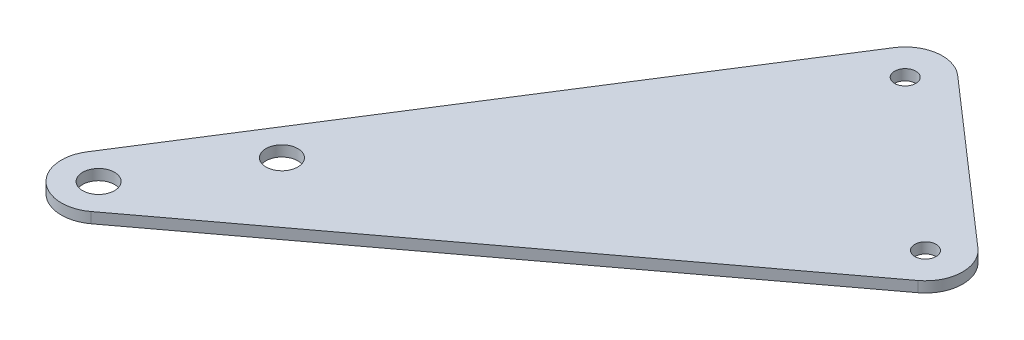
ISO-10303-21;
HEADER;
FILE_DESCRIPTION(('STEP AP214'),'2;1');
FILE_NAME('part.step','',(''),(''),'','','');
FILE_SCHEMA(('AUTOMOTIVE_DESIGN { 1 0 10303 214 1 1 1 1 }'));
ENDSEC;
DATA;
#1=APPLICATION_CONTEXT('core data for automotive mechanical design processes');
#2=APPLICATION_PROTOCOL_DEFINITION('international standard','automotive_design',2000,#1);
#3=PRODUCT_CONTEXT('',#1,'mechanical');
#4=PRODUCT('Part','Part','',(#3));
#5=PRODUCT_RELATED_PRODUCT_CATEGORY('part','',(#4));
#6=PRODUCT_DEFINITION_FORMATION('','',#4);
#7=PRODUCT_DEFINITION_CONTEXT('part definition',#1,'design');
#8=PRODUCT_DEFINITION('design','',#6,#7);
#9=PRODUCT_DEFINITION_SHAPE('','',#8);
#10=(LENGTH_UNIT() NAMED_UNIT(*) SI_UNIT(.MILLI.,.METRE.));
#11=(NAMED_UNIT(*) PLANE_ANGLE_UNIT() SI_UNIT($,.RADIAN.));
#12=(NAMED_UNIT(*) SI_UNIT($,.STERADIAN.) SOLID_ANGLE_UNIT());
#13=UNCERTAINTY_MEASURE_WITH_UNIT(LENGTH_MEASURE(1.E-05),#10,'distance_accuracy_value','');
#14=(GEOMETRIC_REPRESENTATION_CONTEXT(3) GLOBAL_UNCERTAINTY_ASSIGNED_CONTEXT((#13)) GLOBAL_UNIT_ASSIGNED_CONTEXT((#10,
#11,#12)) REPRESENTATION_CONTEXT('',''));
#15=CARTESIAN_POINT('',(0.,0.,0.));
#16=DIRECTION('',(0.,0.,1.));
#17=DIRECTION('',(1.,0.,0.));
#18=AXIS2_PLACEMENT_3D('',#15,#16,#17);
#19=CARTESIAN_POINT('',(1696.36798293908,2.,948.360954862858));
#20=DIRECTION('',(0.,1.,0.));
#21=DIRECTION('',(0.,0.,1.));
#22=AXIS2_PLACEMENT_3D('',#19,#20,#21);
#23=PLANE('',#22);
#24=CARTESIAN_POINT('',(1696.36798293908,2.,948.360954862858));
#25=DIRECTION('',(0.,1.,0.));
#26=DIRECTION('',(0.,0.,1.));
#27=AXIS2_PLACEMENT_3D('',#24,#25,#26);
#28=CIRCLE('',#27,2.99999999999994);
#29=CARTESIAN_POINT('',(1696.36798293908,2.,951.360954862858));
#30=VERTEX_POINT('',#29);
#31=EDGE_CURVE('E190',#30,#30,#28,.T.);
#32=ORIENTED_EDGE('',*,*,#31,.F.);
#33=EDGE_LOOP('',(#32));
#34=FACE_BOUND('',#33,.T.);
#35=CARTESIAN_POINT('',(1755.29624866515,2.,855.476836206733));
#36=DIRECTION('',(0.,1.,0.));
#37=DIRECTION('',(0.,0.,1.));
#38=AXIS2_PLACEMENT_3D('',#35,#36,#37);
#39=CIRCLE('',#38,2.0000000000001);
#40=CARTESIAN_POINT('',(1755.29624866515,2.,857.476836206733));
#41=VERTEX_POINT('',#40);
#42=EDGE_CURVE('E123',#41,#41,#39,.T.);
#43=ORIENTED_EDGE('',*,*,#42,.F.);
#44=EDGE_LOOP('',(#43));
#45=FACE_BOUND('',#44,.T.);
#46=CARTESIAN_POINT('',(1696.36798293908,2.,948.360954862858));
#47=DIRECTION('',(0.,1.,0.));
#48=DIRECTION('',(0.,0.,1.));
#49=AXIS2_PLACEMENT_3D('',#46,#47,#48);
#50=CIRCLE('',#49,7.00000000000001);
#51=CARTESIAN_POINT('',(1690.45717538824,2.,944.610974316654));
#52=VERTEX_POINT('',#51);
#53=CARTESIAN_POINT('',(1700.55912281539,2.,953.967589016899));
#54=VERTEX_POINT('',#53);
#55=EDGE_CURVE('E130',#52,#54,#50,.T.);
#56=ORIENTED_EDGE('',*,*,#55,.T.);
#57=DIRECTION('',(0.800947736291568,0.,-0.598734268043356));
#58=VECTOR('',#57,1.);
#59=CARTESIAN_POINT('',(1700.55912281539,2.,953.967589016899));
#60=LINE('',#59,#58);
#61=CARTESIAN_POINT('',(1789.61532732915,2.,887.395203568695));
#62=VERTEX_POINT('',#61);
#63=EDGE_CURVE('E88',#54,#62,#60,.T.);
#64=ORIENTED_EDGE('',*,*,#63,.T.);
#65=CARTESIAN_POINT('',(1785.42418745285,2.,881.788569414654));
#66=DIRECTION('',(0.,1.,0.));
#67=DIRECTION('',(0.,0.,1.));
#68=AXIS2_PLACEMENT_3D('',#65,#66,#67);
#69=CIRCLE('',#68,6.99999999999997);
#70=CARTESIAN_POINT('',(1790.02874076423,2.,876.516180126807));
#71=VERTEX_POINT('',#70);
#72=EDGE_CURVE('E101',#62,#71,#69,.T.);
#73=ORIENTED_EDGE('',*,*,#72,.T.);
#74=DIRECTION('',(-0.753198469692406,0.,-0.657793330198033));
#75=VECTOR('',#74,1.);
#76=CARTESIAN_POINT('',(1790.02874076423,2.,876.516180126807));
#77=LINE('',#76,#75);
#78=CARTESIAN_POINT('',(1759.90080197654,2.,850.204446918886));
#79=VERTEX_POINT('',#78);
#80=EDGE_CURVE('E95',#71,#79,#77,.T.);
#81=ORIENTED_EDGE('',*,*,#80,.T.);
#82=CARTESIAN_POINT('',(1755.29624866515,2.,855.476836206733));
#83=DIRECTION('',(0.,1.,0.));
#84=DIRECTION('',(0.,0.,1.));
#85=AXIS2_PLACEMENT_3D('',#82,#83,#84);
#86=CIRCLE('',#85,6.99999999999992);
#87=CARTESIAN_POINT('',(1749.38544111431,2.,851.726855660529));
#88=VERTEX_POINT('',#87);
#89=EDGE_CURVE('E99',#79,#88,#86,.T.);
#90=ORIENTED_EDGE('',*,*,#89,.T.);
#91=DIRECTION('',(-0.535711506600463,0.,0.844401078691792));
#92=VECTOR('',#91,1.);
#93=CARTESIAN_POINT('',(1690.45717538824,2.,944.610974316654));
#94=LINE('',#93,#92);
#95=EDGE_CURVE('E51',#88,#52,#94,.T.);
#96=ORIENTED_EDGE('',*,*,#95,.T.);
#97=EDGE_LOOP('',(#56,#64,#73,#81,#90,#96));
#98=FACE_BOUND('',#97,.T.);
#99=CARTESIAN_POINT('',(1785.42418745285,2.,881.788569414654));
#100=DIRECTION('',(0.,1.,0.));
#101=DIRECTION('',(0.,0.,1.));
#102=AXIS2_PLACEMENT_3D('',#99,#100,#101);
#103=CIRCLE('',#102,2.0000000000001);
#104=CARTESIAN_POINT('',(1785.42418745285,2.,883.788569414654));
#105=VERTEX_POINT('',#104);
#106=EDGE_CURVE('E196',#105,#105,#103,.T.);
#107=ORIENTED_EDGE('',*,*,#106,.F.);
#108=EDGE_LOOP('',(#107));
#109=FACE_BOUND('',#108,.T.);
#110=CARTESIAN_POINT('',(1709.76077060409,2.,927.250927895563));
#111=DIRECTION('',(0.,1.,0.));
#112=DIRECTION('',(0.,0.,1.));
#113=AXIS2_PLACEMENT_3D('',#110,#111,#112);
#114=CIRCLE('',#113,2.99999999999994);
#115=CARTESIAN_POINT('',(1709.76077060409,2.,930.250927895563));
#116=VERTEX_POINT('',#115);
#117=EDGE_CURVE('E181',#116,#116,#114,.T.);
#118=ORIENTED_EDGE('',*,*,#117,.F.);
#119=EDGE_LOOP('',(#118));
#120=FACE_BOUND('',#119,.T.);
#121=ADVANCED_FACE('F34',(#34,#45,#98,#109,#120),#23,.T.);
#122=CARTESIAN_POINT('',(1696.36798293908,0.,948.360954862858));
#123=DIRECTION('',(0.,1.,0.));
#124=DIRECTION('',(0.,0.,1.));
#125=AXIS2_PLACEMENT_3D('',#122,#123,#124);
#126=PLANE('',#125);
#127=CARTESIAN_POINT('',(1696.36798293908,0.,948.360954862858));
#128=DIRECTION('',(0.,1.,0.));
#129=DIRECTION('',(0.,0.,1.));
#130=AXIS2_PLACEMENT_3D('',#127,#128,#129);
#131=CIRCLE('',#130,7.00000000000001);
#132=CARTESIAN_POINT('',(1690.45717538824,0.,944.610974316654));
#133=VERTEX_POINT('',#132);
#134=CARTESIAN_POINT('',(1700.55912281539,0.,953.967589016899));
#135=VERTEX_POINT('',#134);
#136=EDGE_CURVE('E119',#133,#135,#131,.T.);
#137=ORIENTED_EDGE('',*,*,#136,.F.);
#138=DIRECTION('',(-0.535711506600463,0.,0.844401078691792));
#139=VECTOR('',#138,1.);
#140=CARTESIAN_POINT('',(1690.45717538824,0.,944.610974316654));
#141=LINE('',#140,#139);
#142=CARTESIAN_POINT('',(1749.38544111431,0.,851.726855660529));
#143=VERTEX_POINT('',#142);
#144=EDGE_CURVE('E80',#143,#133,#141,.T.);
#145=ORIENTED_EDGE('',*,*,#144,.F.);
#146=CARTESIAN_POINT('',(1755.29624866515,0.,855.476836206733));
#147=DIRECTION('',(0.,1.,0.));
#148=DIRECTION('',(0.,0.,1.));
#149=AXIS2_PLACEMENT_3D('',#146,#147,#148);
#150=CIRCLE('',#149,6.99999999999992);
#151=CARTESIAN_POINT('',(1759.90080197654,0.,850.204446918886));
#152=VERTEX_POINT('',#151);
#153=EDGE_CURVE('E74',#152,#143,#150,.T.);
#154=ORIENTED_EDGE('',*,*,#153,.F.);
#155=DIRECTION('',(-0.753198469692406,0.,-0.657793330198033));
#156=VECTOR('',#155,1.);
#157=CARTESIAN_POINT('',(1790.02874076423,0.,876.516180126807));
#158=LINE('',#157,#156);
#159=CARTESIAN_POINT('',(1790.02874076423,0.,876.516180126807));
#160=VERTEX_POINT('',#159);
#161=EDGE_CURVE('E109',#160,#152,#158,.T.);
#162=ORIENTED_EDGE('',*,*,#161,.F.);
#163=CARTESIAN_POINT('',(1785.42418745285,0.,881.788569414654));
#164=DIRECTION('',(0.,1.,0.));
#165=DIRECTION('',(0.,0.,1.));
#166=AXIS2_PLACEMENT_3D('',#163,#164,#165);
#167=CIRCLE('',#166,6.99999999999997);
#168=CARTESIAN_POINT('',(1789.61532732915,0.,887.395203568695));
#169=VERTEX_POINT('',#168);
#170=EDGE_CURVE('E125',#169,#160,#167,.T.);
#171=ORIENTED_EDGE('',*,*,#170,.F.);
#172=DIRECTION('',(0.800947736291568,0.,-0.598734268043356));
#173=VECTOR('',#172,1.);
#174=CARTESIAN_POINT('',(1700.55912281539,0.,953.967589016899));
#175=LINE('',#174,#173);
#176=EDGE_CURVE('E122',#135,#169,#175,.T.);
#177=ORIENTED_EDGE('',*,*,#176,.F.);
#178=EDGE_LOOP('',(#137,#145,#154,#162,#171,#177));
#179=FACE_BOUND('',#178,.T.);
#180=CARTESIAN_POINT('',(1755.29624866515,0.,855.476836206733));
#181=DIRECTION('',(0.,1.,0.));
#182=DIRECTION('',(0.,0.,1.));
#183=AXIS2_PLACEMENT_3D('',#180,#181,#182);
#184=CIRCLE('',#183,2.0000000000001);
#185=CARTESIAN_POINT('',(1755.29624866515,0.,857.476836206733));
#186=VERTEX_POINT('',#185);
#187=EDGE_CURVE('E199',#186,#186,#184,.T.);
#188=ORIENTED_EDGE('',*,*,#187,.T.);
#189=EDGE_LOOP('',(#188));
#190=FACE_BOUND('',#189,.T.);
#191=CARTESIAN_POINT('',(1785.42418745285,0.,881.788569414654));
#192=DIRECTION('',(0.,1.,0.));
#193=DIRECTION('',(0.,0.,1.));
#194=AXIS2_PLACEMENT_3D('',#191,#192,#193);
#195=CIRCLE('',#194,2.0000000000001);
#196=CARTESIAN_POINT('',(1785.42418745285,0.,883.788569414654));
#197=VERTEX_POINT('',#196);
#198=EDGE_CURVE('E193',#197,#197,#195,.T.);
#199=ORIENTED_EDGE('',*,*,#198,.T.);
#200=EDGE_LOOP('',(#199));
#201=FACE_BOUND('',#200,.T.);
#202=CARTESIAN_POINT('',(1696.36798293908,0.,948.360954862858));
#203=DIRECTION('',(0.,1.,0.));
#204=DIRECTION('',(0.,0.,1.));
#205=AXIS2_PLACEMENT_3D('',#202,#203,#204);
#206=CIRCLE('',#205,2.99999999999994);
#207=CARTESIAN_POINT('',(1696.36798293908,0.,951.360954862858));
#208=VERTEX_POINT('',#207);
#209=EDGE_CURVE('E187',#208,#208,#206,.T.);
#210=ORIENTED_EDGE('',*,*,#209,.T.);
#211=EDGE_LOOP('',(#210));
#212=FACE_BOUND('',#211,.T.);
#213=CARTESIAN_POINT('',(1709.76077060409,0.,927.250927895563));
#214=DIRECTION('',(0.,1.,0.));
#215=DIRECTION('',(0.,0.,1.));
#216=AXIS2_PLACEMENT_3D('',#213,#214,#215);
#217=CIRCLE('',#216,2.99999999999994);
#218=CARTESIAN_POINT('',(1709.76077060409,0.,930.250927895563));
#219=VERTEX_POINT('',#218);
#220=EDGE_CURVE('E184',#219,#219,#217,.T.);
#221=ORIENTED_EDGE('',*,*,#220,.T.);
#222=EDGE_LOOP('',(#221));
#223=FACE_BOUND('',#222,.T.);
#224=ADVANCED_FACE('F139',(#179,#190,#201,#212,#223),#126,.F.);
#225=CARTESIAN_POINT('',(1696.36798293908,2.,948.360954862858));
#226=DIRECTION('',(0.,-1.,0.));
#227=DIRECTION('',(0.,0.,-1.));
#228=AXIS2_PLACEMENT_3D('',#225,#226,#227);
#229=CYLINDRICAL_SURFACE('',#228,7.00000000000001);
#230=ORIENTED_EDGE('',*,*,#136,.T.);
#231=DIRECTION('',(0.,-1.,0.));
#232=VECTOR('',#231,1.);
#233=CARTESIAN_POINT('',(1700.55912281539,2.,953.967589016899));
#234=LINE('',#233,#232);
#235=EDGE_CURVE('E11',#54,#135,#234,.T.);
#236=ORIENTED_EDGE('',*,*,#235,.F.);
#237=ORIENTED_EDGE('',*,*,#55,.F.);
#238=DIRECTION('',(0.,-1.,0.));
#239=VECTOR('',#238,1.);
#240=CARTESIAN_POINT('',(1690.45717538824,2.,944.610974316654));
#241=LINE('',#240,#239);
#242=EDGE_CURVE('E115',#52,#133,#241,.T.);
#243=ORIENTED_EDGE('',*,*,#242,.T.);
#244=EDGE_LOOP('',(#230,#236,#237,#243));
#245=FACE_BOUND('',#244,.T.);
#246=ADVANCED_FACE('F36',(#245),#229,.T.);
#247=CARTESIAN_POINT('',(1700.55912281539,2.,953.967589016899));
#248=DIRECTION('',(-0.598734268043356,0.,-0.800947736291568));
#249=DIRECTION('',(-0.800947736291568,0.,0.598734268043356));
#250=AXIS2_PLACEMENT_3D('',#247,#248,#249);
#251=PLANE('',#250);
#252=ORIENTED_EDGE('',*,*,#176,.T.);
#253=DIRECTION('',(0.,-1.,0.));
#254=VECTOR('',#253,1.);
#255=CARTESIAN_POINT('',(1789.61532732915,2.,887.395203568695));
#256=LINE('',#255,#254);
#257=EDGE_CURVE('E43',#62,#169,#256,.T.);
#258=ORIENTED_EDGE('',*,*,#257,.F.);
#259=ORIENTED_EDGE('',*,*,#63,.F.);
#260=ORIENTED_EDGE('',*,*,#235,.T.);
#261=EDGE_LOOP('',(#252,#258,#259,#260));
#262=FACE_BOUND('',#261,.T.);
#263=ADVANCED_FACE('F257',(#262),#251,.F.);
#264=CARTESIAN_POINT('',(1785.42418745285,2.,881.788569414654));
#265=DIRECTION('',(0.,-1.,0.));
#266=DIRECTION('',(0.,0.,-1.));
#267=AXIS2_PLACEMENT_3D('',#264,#265,#266);
#268=CYLINDRICAL_SURFACE('',#267,6.99999999999997);
#269=ORIENTED_EDGE('',*,*,#170,.T.);
#270=DIRECTION('',(0.,-1.,0.));
#271=VECTOR('',#270,1.);
#272=CARTESIAN_POINT('',(1790.02874076423,2.,876.516180126807));
#273=LINE('',#272,#271);
#274=EDGE_CURVE('E110',#71,#160,#273,.T.);
#275=ORIENTED_EDGE('',*,*,#274,.F.);
#276=ORIENTED_EDGE('',*,*,#72,.F.);
#277=ORIENTED_EDGE('',*,*,#257,.T.);
#278=EDGE_LOOP('',(#269,#275,#276,#277));
#279=FACE_BOUND('',#278,.T.);
#280=ADVANCED_FACE('F136',(#279),#268,.T.);
#281=CARTESIAN_POINT('',(1790.02874076423,2.,876.516180126807));
#282=DIRECTION('',(-0.657793330198033,0.,0.753198469692406));
#283=DIRECTION('',(0.753198469692406,0.,0.657793330198033));
#284=AXIS2_PLACEMENT_3D('',#281,#282,#283);
#285=PLANE('',#284);
#286=ORIENTED_EDGE('',*,*,#161,.T.);
#287=DIRECTION('',(0.,-1.,0.));
#288=VECTOR('',#287,1.);
#289=CARTESIAN_POINT('',(1759.90080197654,2.,850.204446918886));
#290=LINE('',#289,#288);
#291=EDGE_CURVE('E106',#79,#152,#290,.T.);
#292=ORIENTED_EDGE('',*,*,#291,.F.);
#293=ORIENTED_EDGE('',*,*,#80,.F.);
#294=ORIENTED_EDGE('',*,*,#274,.T.);
#295=EDGE_LOOP('',(#286,#292,#293,#294));
#296=FACE_BOUND('',#295,.T.);
#297=ADVANCED_FACE('F107',(#296),#285,.F.);
#298=CARTESIAN_POINT('',(1755.29624866515,2.,855.476836206733));
#299=DIRECTION('',(0.,-1.,0.));
#300=DIRECTION('',(0.,0.,-1.));
#301=AXIS2_PLACEMENT_3D('',#298,#299,#300);
#302=CYLINDRICAL_SURFACE('',#301,6.99999999999992);
#303=ORIENTED_EDGE('',*,*,#153,.T.);
#304=DIRECTION('',(0.,-1.,0.));
#305=VECTOR('',#304,1.);
#306=CARTESIAN_POINT('',(1749.38544111431,2.,851.726855660529));
#307=LINE('',#306,#305);
#308=EDGE_CURVE('E111',#88,#143,#307,.T.);
#309=ORIENTED_EDGE('',*,*,#308,.F.);
#310=ORIENTED_EDGE('',*,*,#89,.F.);
#311=ORIENTED_EDGE('',*,*,#291,.T.);
#312=EDGE_LOOP('',(#303,#309,#310,#311));
#313=FACE_BOUND('',#312,.T.);
#314=ADVANCED_FACE('F113',(#313),#302,.T.);
#315=CARTESIAN_POINT('',(1690.45717538824,2.,944.610974316654));
#316=DIRECTION('',(0.844401078691792,0.,0.535711506600463));
#317=DIRECTION('',(0.535711506600463,0.,-0.844401078691792));
#318=AXIS2_PLACEMENT_3D('',#315,#316,#317);
#319=PLANE('',#318);
#320=ORIENTED_EDGE('',*,*,#144,.T.);
#321=ORIENTED_EDGE('',*,*,#242,.F.);
#322=ORIENTED_EDGE('',*,*,#95,.F.);
#323=ORIENTED_EDGE('',*,*,#308,.T.);
#324=EDGE_LOOP('',(#320,#321,#322,#323));
#325=FACE_BOUND('',#324,.T.);
#326=ADVANCED_FACE('F144',(#325),#319,.F.);
#327=CARTESIAN_POINT('',(1755.29624866515,2.,855.476836206733));
#328=DIRECTION('',(0.,-1.,0.));
#329=DIRECTION('',(0.,0.,-1.));
#330=AXIS2_PLACEMENT_3D('',#327,#328,#329);
#331=CYLINDRICAL_SURFACE('',#330,2.0000000000001);
#332=ORIENTED_EDGE('',*,*,#42,.T.);
#333=EDGE_LOOP('',(#332));
#334=FACE_BOUND('',#333,.T.);
#335=ORIENTED_EDGE('',*,*,#187,.F.);
#336=EDGE_LOOP('',(#335));
#337=FACE_BOUND('',#336,.T.);
#338=ADVANCED_FACE('F146',(#334,#337),#331,.F.);
#339=CARTESIAN_POINT('',(1785.42418745285,2.,881.788569414654));
#340=DIRECTION('',(0.,-1.,0.));
#341=DIRECTION('',(0.,0.,-1.));
#342=AXIS2_PLACEMENT_3D('',#339,#340,#341);
#343=CYLINDRICAL_SURFACE('',#342,2.0000000000001);
#344=ORIENTED_EDGE('',*,*,#106,.T.);
#345=EDGE_LOOP('',(#344));
#346=FACE_BOUND('',#345,.T.);
#347=ORIENTED_EDGE('',*,*,#198,.F.);
#348=EDGE_LOOP('',(#347));
#349=FACE_BOUND('',#348,.T.);
#350=ADVANCED_FACE('F152',(#346,#349),#343,.F.);
#351=CARTESIAN_POINT('',(1696.36798293908,2.,948.360954862858));
#352=DIRECTION('',(0.,-1.,0.));
#353=DIRECTION('',(0.,0.,-1.));
#354=AXIS2_PLACEMENT_3D('',#351,#352,#353);
#355=CYLINDRICAL_SURFACE('',#354,2.99999999999994);
#356=ORIENTED_EDGE('',*,*,#31,.T.);
#357=EDGE_LOOP('',(#356));
#358=FACE_BOUND('',#357,.T.);
#359=ORIENTED_EDGE('',*,*,#209,.F.);
#360=EDGE_LOOP('',(#359));
#361=FACE_BOUND('',#360,.T.);
#362=ADVANCED_FACE('F168',(#358,#361),#355,.F.);
#363=CARTESIAN_POINT('',(1709.76077060409,2.,927.250927895563));
#364=DIRECTION('',(0.,-1.,0.));
#365=DIRECTION('',(0.,0.,-1.));
#366=AXIS2_PLACEMENT_3D('',#363,#364,#365);
#367=CYLINDRICAL_SURFACE('',#366,2.99999999999994);
#368=ORIENTED_EDGE('',*,*,#117,.T.);
#369=EDGE_LOOP('',(#368));
#370=FACE_BOUND('',#369,.T.);
#371=ORIENTED_EDGE('',*,*,#220,.F.);
#372=EDGE_LOOP('',(#371));
#373=FACE_BOUND('',#372,.T.);
#374=ADVANCED_FACE('F172',(#370,#373),#367,.F.);
#375=CLOSED_SHELL('',(#121,#224,#246,#263,#280,#297,#314,#326,#338,#350,#362,#374));
#376=MANIFOLD_SOLID_BREP('B2',#375);
#377=ADVANCED_BREP_SHAPE_REPRESENTATION('',(#18,#376),#14);
#378=SHAPE_DEFINITION_REPRESENTATION(#9,#377);
ENDSEC;
END-ISO-10303-21;
